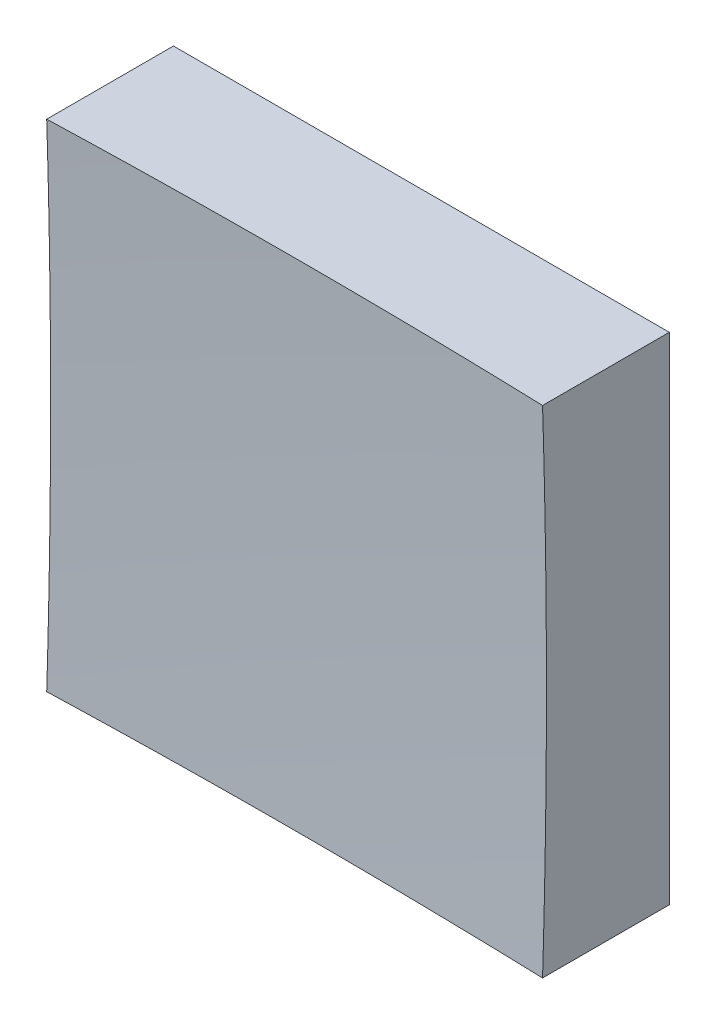
ISO-10303-21;
HEADER;
FILE_DESCRIPTION(('STEP AP214'),'2;1');
FILE_NAME('part.step','',(''),(''),'','','');
FILE_SCHEMA(('AUTOMOTIVE_DESIGN { 1 0 10303 214 1 1 1 1 }'));
ENDSEC;
DATA;
#1=APPLICATION_CONTEXT('core data for automotive mechanical design processes');
#2=APPLICATION_PROTOCOL_DEFINITION('international standard','automotive_design',2000,#1);
#3=PRODUCT_CONTEXT('',#1,'mechanical');
#4=PRODUCT('Part','Part','',(#3));
#5=PRODUCT_RELATED_PRODUCT_CATEGORY('part','',(#4));
#6=PRODUCT_DEFINITION_FORMATION('','',#4);
#7=PRODUCT_DEFINITION_CONTEXT('part definition',#1,'design');
#8=PRODUCT_DEFINITION('design','',#6,#7);
#9=PRODUCT_DEFINITION_SHAPE('','',#8);
#10=(LENGTH_UNIT() NAMED_UNIT(*) SI_UNIT(.MILLI.,.METRE.));
#11=(NAMED_UNIT(*) PLANE_ANGLE_UNIT() SI_UNIT($,.RADIAN.));
#12=(NAMED_UNIT(*) SI_UNIT($,.STERADIAN.) SOLID_ANGLE_UNIT());
#13=UNCERTAINTY_MEASURE_WITH_UNIT(LENGTH_MEASURE(1.E-05),#10,'distance_accuracy_value','');
#14=(GEOMETRIC_REPRESENTATION_CONTEXT(3) GLOBAL_UNCERTAINTY_ASSIGNED_CONTEXT((#13)) GLOBAL_UNIT_ASSIGNED_CONTEXT((#10,
#11,#12)) REPRESENTATION_CONTEXT('',''));
#15=CARTESIAN_POINT('',(0.,0.,0.));
#16=DIRECTION('',(0.,0.,1.));
#17=DIRECTION('',(1.,0.,0.));
#18=AXIS2_PLACEMENT_3D('',#15,#16,#17);
#19=CARTESIAN_POINT('',(-12.5,12.5,20.));
#20=DIRECTION('',(0.,1.,0.));
#21=DIRECTION('',(0.,0.,1.));
#22=AXIS2_PLACEMENT_3D('',#19,#20,#21);
#23=PLANE('',#22);
#24=CARTESIAN_POINT('',(0.,12.5,406.));
#25=DIRECTION('',(0.,1.,0.));
#26=DIRECTION('',(0.,0.,1.));
#27=AXIS2_PLACEMENT_3D('',#24,#25,#26);
#28=CIRCLE('',#27,399.804639792987);
#29=CARTESIAN_POINT('',(12.5,12.5,6.39081592135549));
#30=VERTEX_POINT('',#29);
#31=CARTESIAN_POINT('',(-12.5,12.5,6.39081592135549));
#32=VERTEX_POINT('',#31);
#33=EDGE_CURVE('E79',#30,#32,#28,.T.);
#34=ORIENTED_EDGE('',*,*,#33,.F.);
#35=DIRECTION('',(0.,0.,-1.));
#36=VECTOR('',#35,1.);
#37=CARTESIAN_POINT('',(12.5,12.5,20.));
#38=LINE('',#37,#36);
#39=CARTESIAN_POINT('',(12.5,12.5,0.));
#40=VERTEX_POINT('',#39);
#41=EDGE_CURVE('E85',#30,#40,#38,.T.);
#42=ORIENTED_EDGE('',*,*,#41,.T.);
#43=DIRECTION('',(1.,0.,0.));
#44=VECTOR('',#43,1.);
#45=CARTESIAN_POINT('',(-12.5,12.5,0.));
#46=LINE('',#45,#44);
#47=CARTESIAN_POINT('',(-12.5,12.5,0.));
#48=VERTEX_POINT('',#47);
#49=EDGE_CURVE('E88',#48,#40,#46,.T.);
#50=ORIENTED_EDGE('',*,*,#49,.F.);
#51=DIRECTION('',(0.,0.,-1.));
#52=VECTOR('',#51,1.);
#53=CARTESIAN_POINT('',(-12.5,12.5,20.));
#54=LINE('',#53,#52);
#55=EDGE_CURVE('E47',#32,#48,#54,.T.);
#56=ORIENTED_EDGE('',*,*,#55,.F.);
#57=EDGE_LOOP('',(#34,#42,#50,#56));
#58=FACE_BOUND('',#57,.T.);
#59=ADVANCED_FACE('F39',(#58),#23,.T.);
#60=CARTESIAN_POINT('',(-12.5,12.5,20.));
#61=DIRECTION('',(1.,0.,0.));
#62=DIRECTION('',(0.,1.,0.));
#63=AXIS2_PLACEMENT_3D('',#60,#61,#62);
#64=PLANE('',#63);
#65=DIRECTION('',(0.,0.,-1.));
#66=VECTOR('',#65,1.);
#67=CARTESIAN_POINT('',(-12.5,-12.5,20.));
#68=LINE('',#67,#66);
#69=CARTESIAN_POINT('',(-12.5,-12.5,6.39081592135549));
#70=VERTEX_POINT('',#69);
#71=CARTESIAN_POINT('',(-12.5,-12.5,0.));
#72=VERTEX_POINT('',#71);
#73=EDGE_CURVE('E100',#70,#72,#68,.T.);
#74=ORIENTED_EDGE('',*,*,#73,.F.);
#75=CARTESIAN_POINT('',(-12.5,0.,406.));
#76=DIRECTION('',(1.,0.,0.));
#77=DIRECTION('',(0.,1.,0.));
#78=AXIS2_PLACEMENT_3D('',#75,#76,#77);
#79=CIRCLE('',#78,399.804639792987);
#80=EDGE_CURVE('E89',#70,#32,#79,.T.);
#81=ORIENTED_EDGE('',*,*,#80,.T.);
#82=ORIENTED_EDGE('',*,*,#55,.T.);
#83=DIRECTION('',(0.,-1.,0.));
#84=VECTOR('',#83,1.);
#85=CARTESIAN_POINT('',(-12.5,12.5,0.));
#86=LINE('',#85,#84);
#87=EDGE_CURVE('E97',#48,#72,#86,.T.);
#88=ORIENTED_EDGE('',*,*,#87,.T.);
#89=EDGE_LOOP('',(#74,#81,#82,#88));
#90=FACE_BOUND('',#89,.T.);
#91=ADVANCED_FACE('F122',(#90),#64,.F.);
#92=CARTESIAN_POINT('',(-12.5,-12.5,20.));
#93=DIRECTION('',(0.,1.,0.));
#94=DIRECTION('',(0.,0.,1.));
#95=AXIS2_PLACEMENT_3D('',#92,#93,#94);
#96=PLANE('',#95);
#97=DIRECTION('',(0.,0.,-1.));
#98=VECTOR('',#97,1.);
#99=CARTESIAN_POINT('',(12.5,-12.5,20.));
#100=LINE('',#99,#98);
#101=CARTESIAN_POINT('',(12.5,-12.5,6.39081592135549));
#102=VERTEX_POINT('',#101);
#103=CARTESIAN_POINT('',(12.5,-12.5,0.));
#104=VERTEX_POINT('',#103);
#105=EDGE_CURVE('E96',#102,#104,#100,.T.);
#106=ORIENTED_EDGE('',*,*,#105,.F.);
#107=CARTESIAN_POINT('',(0.,-12.5,406.));
#108=DIRECTION('',(0.,1.,0.));
#109=DIRECTION('',(0.,0.,1.));
#110=AXIS2_PLACEMENT_3D('',#107,#108,#109);
#111=CIRCLE('',#110,399.804639792987);
#112=EDGE_CURVE('E53',#102,#70,#111,.T.);
#113=ORIENTED_EDGE('',*,*,#112,.T.);
#114=ORIENTED_EDGE('',*,*,#73,.T.);
#115=DIRECTION('',(1.,0.,0.));
#116=VECTOR('',#115,1.);
#117=CARTESIAN_POINT('',(-12.5,-12.5,0.));
#118=LINE('',#117,#116);
#119=EDGE_CURVE('E102',#72,#104,#118,.T.);
#120=ORIENTED_EDGE('',*,*,#119,.T.);
#121=EDGE_LOOP('',(#106,#113,#114,#120));
#122=FACE_BOUND('',#121,.T.);
#123=ADVANCED_FACE('F121',(#122),#96,.F.);
#124=CARTESIAN_POINT('',(12.5,12.5,20.));
#125=DIRECTION('',(1.,0.,0.));
#126=DIRECTION('',(0.,1.,0.));
#127=AXIS2_PLACEMENT_3D('',#124,#125,#126);
#128=PLANE('',#127);
#129=CARTESIAN_POINT('',(12.5,0.,406.));
#130=DIRECTION('',(1.,0.,0.));
#131=DIRECTION('',(0.,1.,0.));
#132=AXIS2_PLACEMENT_3D('',#129,#130,#131);
#133=CIRCLE('',#132,399.804639792987);
#134=EDGE_CURVE('E11',#102,#30,#133,.T.);
#135=ORIENTED_EDGE('',*,*,#134,.F.);
#136=ORIENTED_EDGE('',*,*,#105,.T.);
#137=DIRECTION('',(0.,-1.,0.));
#138=VECTOR('',#137,1.);
#139=CARTESIAN_POINT('',(12.5,12.5,0.));
#140=LINE('',#139,#138);
#141=EDGE_CURVE('E93',#40,#104,#140,.T.);
#142=ORIENTED_EDGE('',*,*,#141,.F.);
#143=ORIENTED_EDGE('',*,*,#41,.F.);
#144=EDGE_LOOP('',(#135,#136,#142,#143));
#145=FACE_BOUND('',#144,.T.);
#146=ADVANCED_FACE('F91',(#145),#128,.T.);
#147=CARTESIAN_POINT('',(0.,0.,0.));
#148=DIRECTION('',(0.,0.,-1.));
#149=DIRECTION('',(-1.,0.,0.));
#150=AXIS2_PLACEMENT_3D('',#147,#148,#149);
#151=PLANE('',#150);
#152=ORIENTED_EDGE('',*,*,#49,.T.);
#153=ORIENTED_EDGE('',*,*,#141,.T.);
#154=ORIENTED_EDGE('',*,*,#119,.F.);
#155=ORIENTED_EDGE('',*,*,#87,.F.);
#156=EDGE_LOOP('',(#152,#153,#154,#155));
#157=FACE_BOUND('',#156,.T.);
#158=ADVANCED_FACE('F125',(#157),#151,.T.);
#159=CARTESIAN_POINT('',(0.,0.,406.));
#160=DIRECTION('',(0.,0.,1.));
#161=DIRECTION('',(1.,0.,0.));
#162=AXIS2_PLACEMENT_3D('',#159,#160,#161);
#163=SPHERICAL_SURFACE('',#162,400.);
#164=ORIENTED_EDGE('',*,*,#33,.T.);
#165=ORIENTED_EDGE('',*,*,#80,.F.);
#166=ORIENTED_EDGE('',*,*,#112,.F.);
#167=ORIENTED_EDGE('',*,*,#134,.T.);
#168=EDGE_LOOP('',(#164,#165,#166,#167));
#169=FACE_BOUND('',#168,.T.);
#170=ADVANCED_FACE('F78',(#169),#163,.F.);
#171=CLOSED_SHELL('',(#59,#91,#123,#146,#158,#170));
#172=MANIFOLD_SOLID_BREP('B2',#171);
#173=ADVANCED_BREP_SHAPE_REPRESENTATION('',(#18,#172),#14);
#174=SHAPE_DEFINITION_REPRESENTATION(#9,#173);
ENDSEC;
END-ISO-10303-21;
